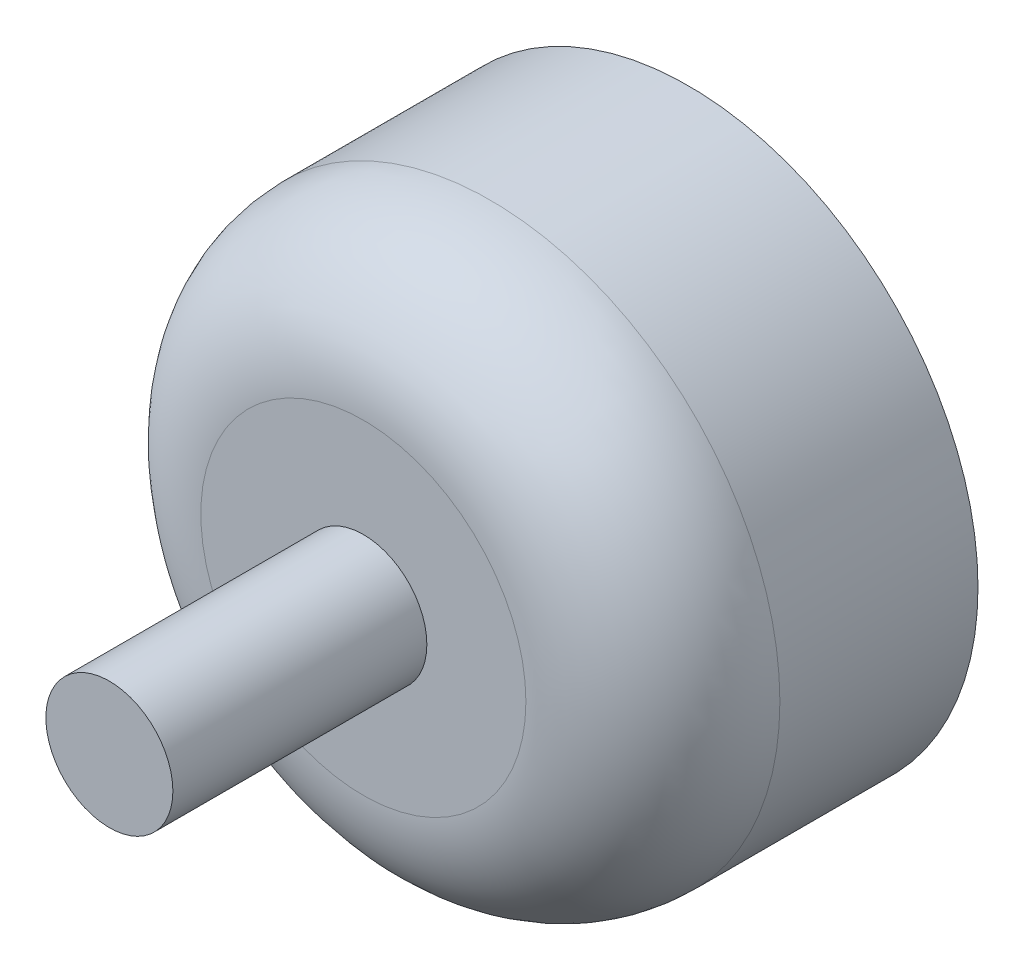
ISO-10303-21;
HEADER;
FILE_DESCRIPTION(('STEP AP214'),'2;1');
FILE_NAME('part.step','',(''),(''),'','','');
FILE_SCHEMA(('AUTOMOTIVE_DESIGN { 1 0 10303 214 1 1 1 1 }'));
ENDSEC;
DATA;
#1=APPLICATION_CONTEXT('core data for automotive mechanical design processes');
#2=APPLICATION_PROTOCOL_DEFINITION('international standard','automotive_design',2000,#1);
#3=PRODUCT_CONTEXT('',#1,'mechanical');
#4=PRODUCT('Part','Part','',(#3));
#5=PRODUCT_RELATED_PRODUCT_CATEGORY('part','',(#4));
#6=PRODUCT_DEFINITION_FORMATION('','',#4);
#7=PRODUCT_DEFINITION_CONTEXT('part definition',#1,'design');
#8=PRODUCT_DEFINITION('design','',#6,#7);
#9=PRODUCT_DEFINITION_SHAPE('','',#8);
#10=(LENGTH_UNIT() NAMED_UNIT(*) SI_UNIT(.MILLI.,.METRE.));
#11=(NAMED_UNIT(*) PLANE_ANGLE_UNIT() SI_UNIT($,.RADIAN.));
#12=(NAMED_UNIT(*) SI_UNIT($,.STERADIAN.) SOLID_ANGLE_UNIT());
#13=UNCERTAINTY_MEASURE_WITH_UNIT(LENGTH_MEASURE(1.E-05),#10,'distance_accuracy_value','');
#14=(GEOMETRIC_REPRESENTATION_CONTEXT(3) GLOBAL_UNCERTAINTY_ASSIGNED_CONTEXT((#13)) GLOBAL_UNIT_ASSIGNED_CONTEXT((#10,
#11,#12)) REPRESENTATION_CONTEXT('',''));
#15=CARTESIAN_POINT('',(0.,0.,0.));
#16=DIRECTION('',(0.,0.,1.));
#17=DIRECTION('',(1.,0.,0.));
#18=AXIS2_PLACEMENT_3D('',#15,#16,#17);
#19=CARTESIAN_POINT('',(0.,0.,12.8));
#20=DIRECTION('',(0.,0.,-1.));
#21=DIRECTION('',(-1.,0.,0.));
#22=AXIS2_PLACEMENT_3D('',#19,#20,#21);
#23=CYLINDRICAL_SURFACE('',#22,11.4);
#24=CARTESIAN_POINT('',(0.,0.,7.8));
#25=DIRECTION('',(0.,0.,1.));
#26=DIRECTION('',(1.,0.,0.));
#27=AXIS2_PLACEMENT_3D('',#24,#25,#26);
#28=CIRCLE('',#27,11.4);
#29=CARTESIAN_POINT('',(11.4,0.,7.8));
#30=VERTEX_POINT('',#29);
#31=EDGE_CURVE('E10',#30,#30,#28,.F.);
#32=ORIENTED_EDGE('',*,*,#31,.T.);
#33=EDGE_LOOP('',(#32));
#34=FACE_BOUND('',#33,.T.);
#35=CARTESIAN_POINT('',(0.,0.,0.));
#36=DIRECTION('',(0.,0.,1.));
#37=DIRECTION('',(1.,0.,0.));
#38=AXIS2_PLACEMENT_3D('',#35,#36,#37);
#39=CIRCLE('',#38,11.4);
#40=CARTESIAN_POINT('',(11.4,0.,0.));
#41=VERTEX_POINT('',#40);
#42=EDGE_CURVE('E52',#41,#41,#39,.T.);
#43=ORIENTED_EDGE('',*,*,#42,.T.);
#44=EDGE_LOOP('',(#43));
#45=FACE_BOUND('',#44,.T.);
#46=ADVANCED_FACE('F31',(#34,#45),#23,.T.);
#47=CARTESIAN_POINT('',(0.,0.,12.8));
#48=DIRECTION('',(0.,0.,1.));
#49=DIRECTION('',(1.,0.,0.));
#50=AXIS2_PLACEMENT_3D('',#47,#48,#49);
#51=PLANE('',#50);
#52=CARTESIAN_POINT('',(0.,0.,12.8));
#53=DIRECTION('',(0.,0.,1.));
#54=DIRECTION('',(1.,0.,0.));
#55=AXIS2_PLACEMENT_3D('',#52,#53,#54);
#56=CIRCLE('',#55,6.4);
#57=CARTESIAN_POINT('',(6.4,0.,12.8));
#58=VERTEX_POINT('',#57);
#59=EDGE_CURVE('E38',#58,#58,#56,.T.);
#60=ORIENTED_EDGE('',*,*,#59,.T.);
#61=EDGE_LOOP('',(#60));
#62=FACE_BOUND('',#61,.T.);
#63=CARTESIAN_POINT('',(0.,0.,12.8));
#64=DIRECTION('',(0.,0.,1.));
#65=DIRECTION('',(1.,0.,0.));
#66=AXIS2_PLACEMENT_3D('',#63,#64,#65);
#67=CIRCLE('',#66,2.5);
#68=CARTESIAN_POINT('',(2.5,0.,12.8));
#69=VERTEX_POINT('',#68);
#70=EDGE_CURVE('E42',#69,#69,#67,.T.);
#71=ORIENTED_EDGE('',*,*,#70,.F.);
#72=EDGE_LOOP('',(#71));
#73=FACE_BOUND('',#72,.T.);
#74=ADVANCED_FACE('F100',(#62,#73),#51,.T.);
#75=CARTESIAN_POINT('',(0.,0.,0.));
#76=DIRECTION('',(0.,0.,1.));
#77=DIRECTION('',(1.,0.,0.));
#78=AXIS2_PLACEMENT_3D('',#75,#76,#77);
#79=PLANE('',#78);
#80=CARTESIAN_POINT('',(0.,0.,0.));
#81=DIRECTION('',(0.,0.,1.));
#82=DIRECTION('',(1.,0.,0.));
#83=AXIS2_PLACEMENT_3D('',#80,#81,#82);
#84=CIRCLE('',#83,3.);
#85=CARTESIAN_POINT('',(3.,0.,0.));
#86=VERTEX_POINT('',#85);
#87=EDGE_CURVE('E49',#86,#86,#84,.F.);
#88=ORIENTED_EDGE('',*,*,#87,.F.);
#89=EDGE_LOOP('',(#88));
#90=FACE_BOUND('',#89,.T.);
#91=CARTESIAN_POINT('',(0.,6.,0.));
#92=DIRECTION('',(0.,0.,-1.));
#93=DIRECTION('',(0.,1.,0.));
#94=AXIS2_PLACEMENT_3D('',#91,#92,#93);
#95=CIRCLE('',#94,1.);
#96=CARTESIAN_POINT('',(0.,7.,0.));
#97=VERTEX_POINT('',#96);
#98=EDGE_CURVE('E75',#97,#97,#95,.T.);
#99=ORIENTED_EDGE('',*,*,#98,.F.);
#100=EDGE_LOOP('',(#99));
#101=FACE_BOUND('',#100,.T.);
#102=CARTESIAN_POINT('',(6.,0.,0.));
#103=DIRECTION('',(0.,0.,-1.));
#104=DIRECTION('',(1.,0.,0.));
#105=AXIS2_PLACEMENT_3D('',#102,#103,#104);
#106=CIRCLE('',#105,1.);
#107=CARTESIAN_POINT('',(7.,0.,0.));
#108=VERTEX_POINT('',#107);
#109=EDGE_CURVE('E69',#108,#108,#106,.T.);
#110=ORIENTED_EDGE('',*,*,#109,.F.);
#111=EDGE_LOOP('',(#110));
#112=FACE_BOUND('',#111,.T.);
#113=CARTESIAN_POINT('',(0.,-6.,0.));
#114=DIRECTION('',(0.,0.,-1.));
#115=DIRECTION('',(0.,-1.,0.));
#116=AXIS2_PLACEMENT_3D('',#113,#114,#115);
#117=CIRCLE('',#116,1.);
#118=CARTESIAN_POINT('',(0.,-7.,0.));
#119=VERTEX_POINT('',#118);
#120=EDGE_CURVE('E62',#119,#119,#117,.T.);
#121=ORIENTED_EDGE('',*,*,#120,.F.);
#122=EDGE_LOOP('',(#121));
#123=FACE_BOUND('',#122,.T.);
#124=CARTESIAN_POINT('',(-6.,0.,0.));
#125=DIRECTION('',(0.,0.,-1.));
#126=DIRECTION('',(-1.,0.,0.));
#127=AXIS2_PLACEMENT_3D('',#124,#125,#126);
#128=CIRCLE('',#127,1.);
#129=CARTESIAN_POINT('',(-7.,0.,0.));
#130=VERTEX_POINT('',#129);
#131=EDGE_CURVE('E56',#130,#130,#128,.T.);
#132=ORIENTED_EDGE('',*,*,#131,.F.);
#133=EDGE_LOOP('',(#132));
#134=FACE_BOUND('',#133,.T.);
#135=ORIENTED_EDGE('',*,*,#42,.F.);
#136=EDGE_LOOP('',(#135));
#137=FACE_BOUND('',#136,.T.);
#138=ADVANCED_FACE('F102',(#90,#101,#112,#123,#134,#137),#79,.F.);
#139=CARTESIAN_POINT('',(-6.,0.,3.));
#140=DIRECTION('',(0.,0.,-1.));
#141=DIRECTION('',(-1.,0.,0.));
#142=AXIS2_PLACEMENT_3D('',#139,#140,#141);
#143=CYLINDRICAL_SURFACE('',#142,1.);
#144=CARTESIAN_POINT('',(-6.,0.,3.));
#145=DIRECTION('',(0.,0.,-1.));
#146=DIRECTION('',(-1.,0.,0.));
#147=AXIS2_PLACEMENT_3D('',#144,#145,#146);
#148=CIRCLE('',#147,1.);
#149=CARTESIAN_POINT('',(-7.,0.,3.));
#150=VERTEX_POINT('',#149);
#151=EDGE_CURVE('E55',#150,#150,#148,.T.);
#152=ORIENTED_EDGE('',*,*,#151,.F.);
#153=EDGE_LOOP('',(#152));
#154=FACE_BOUND('',#153,.T.);
#155=ORIENTED_EDGE('',*,*,#131,.T.);
#156=EDGE_LOOP('',(#155));
#157=FACE_BOUND('',#156,.T.);
#158=ADVANCED_FACE('F108',(#154,#157),#143,.F.);
#159=CARTESIAN_POINT('',(-6.,0.,3.));
#160=DIRECTION('',(0.,0.,-1.));
#161=DIRECTION('',(-1.,0.,0.));
#162=AXIS2_PLACEMENT_3D('',#159,#160,#161);
#163=PLANE('',#162);
#164=ORIENTED_EDGE('',*,*,#151,.T.);
#165=EDGE_LOOP('',(#164));
#166=FACE_BOUND('',#165,.T.);
#167=ADVANCED_FACE('F114',(#166),#163,.T.);
#168=CARTESIAN_POINT('',(0.,-6.,3.));
#169=DIRECTION('',(0.,0.,-1.));
#170=DIRECTION('',(-1.,0.,0.));
#171=AXIS2_PLACEMENT_3D('',#168,#169,#170);
#172=CYLINDRICAL_SURFACE('',#171,1.);
#173=CARTESIAN_POINT('',(0.,-6.,3.));
#174=DIRECTION('',(0.,0.,-1.));
#175=DIRECTION('',(0.,-1.,0.));
#176=AXIS2_PLACEMENT_3D('',#173,#174,#175);
#177=CIRCLE('',#176,1.);
#178=CARTESIAN_POINT('',(0.,-7.,3.));
#179=VERTEX_POINT('',#178);
#180=EDGE_CURVE('E65',#179,#179,#177,.T.);
#181=ORIENTED_EDGE('',*,*,#180,.F.);
#182=EDGE_LOOP('',(#181));
#183=FACE_BOUND('',#182,.T.);
#184=ORIENTED_EDGE('',*,*,#120,.T.);
#185=EDGE_LOOP('',(#184));
#186=FACE_BOUND('',#185,.T.);
#187=ADVANCED_FACE('F118',(#183,#186),#172,.F.);
#188=CARTESIAN_POINT('',(0.,-6.,3.));
#189=DIRECTION('',(0.,0.,-1.));
#190=DIRECTION('',(0.,-1.,0.));
#191=AXIS2_PLACEMENT_3D('',#188,#189,#190);
#192=PLANE('',#191);
#193=ORIENTED_EDGE('',*,*,#180,.T.);
#194=EDGE_LOOP('',(#193));
#195=FACE_BOUND('',#194,.T.);
#196=ADVANCED_FACE('F122',(#195),#192,.T.);
#197=CARTESIAN_POINT('',(6.,0.,3.));
#198=DIRECTION('',(0.,0.,-1.));
#199=DIRECTION('',(-1.,0.,0.));
#200=AXIS2_PLACEMENT_3D('',#197,#198,#199);
#201=CYLINDRICAL_SURFACE('',#200,1.);
#202=CARTESIAN_POINT('',(6.,0.,3.));
#203=DIRECTION('',(0.,0.,-1.));
#204=DIRECTION('',(1.,0.,0.));
#205=AXIS2_PLACEMENT_3D('',#202,#203,#204);
#206=CIRCLE('',#205,1.);
#207=CARTESIAN_POINT('',(7.,0.,3.));
#208=VERTEX_POINT('',#207);
#209=EDGE_CURVE('E72',#208,#208,#206,.T.);
#210=ORIENTED_EDGE('',*,*,#209,.F.);
#211=EDGE_LOOP('',(#210));
#212=FACE_BOUND('',#211,.T.);
#213=ORIENTED_EDGE('',*,*,#109,.T.);
#214=EDGE_LOOP('',(#213));
#215=FACE_BOUND('',#214,.T.);
#216=ADVANCED_FACE('F126',(#212,#215),#201,.F.);
#217=CARTESIAN_POINT('',(6.,0.,3.));
#218=DIRECTION('',(0.,0.,-1.));
#219=DIRECTION('',(1.,0.,0.));
#220=AXIS2_PLACEMENT_3D('',#217,#218,#219);
#221=PLANE('',#220);
#222=ORIENTED_EDGE('',*,*,#209,.T.);
#223=EDGE_LOOP('',(#222));
#224=FACE_BOUND('',#223,.T.);
#225=ADVANCED_FACE('F130',(#224),#221,.T.);
#226=CARTESIAN_POINT('',(0.,6.,3.));
#227=DIRECTION('',(0.,0.,-1.));
#228=DIRECTION('',(-1.,0.,0.));
#229=AXIS2_PLACEMENT_3D('',#226,#227,#228);
#230=CYLINDRICAL_SURFACE('',#229,1.);
#231=CARTESIAN_POINT('',(0.,6.,3.));
#232=DIRECTION('',(0.,0.,-1.));
#233=DIRECTION('',(0.,1.,0.));
#234=AXIS2_PLACEMENT_3D('',#231,#232,#233);
#235=CIRCLE('',#234,1.);
#236=CARTESIAN_POINT('',(0.,7.,3.));
#237=VERTEX_POINT('',#236);
#238=EDGE_CURVE('E59',#237,#237,#235,.T.);
#239=ORIENTED_EDGE('',*,*,#238,.F.);
#240=EDGE_LOOP('',(#239));
#241=FACE_BOUND('',#240,.T.);
#242=ORIENTED_EDGE('',*,*,#98,.T.);
#243=EDGE_LOOP('',(#242));
#244=FACE_BOUND('',#243,.T.);
#245=ADVANCED_FACE('F134',(#241,#244),#230,.F.);
#246=CARTESIAN_POINT('',(0.,6.,3.));
#247=DIRECTION('',(0.,0.,-1.));
#248=DIRECTION('',(0.,1.,0.));
#249=AXIS2_PLACEMENT_3D('',#246,#247,#248);
#250=PLANE('',#249);
#251=ORIENTED_EDGE('',*,*,#238,.T.);
#252=EDGE_LOOP('',(#251));
#253=FACE_BOUND('',#252,.T.);
#254=ADVANCED_FACE('F138',(#253),#250,.T.);
#255=CARTESIAN_POINT('',(0.,0.,-0.5));
#256=DIRECTION('',(0.,0.,1.));
#257=DIRECTION('',(1.,0.,0.));
#258=AXIS2_PLACEMENT_3D('',#255,#256,#257);
#259=CYLINDRICAL_SURFACE('',#258,3.);
#260=CARTESIAN_POINT('',(0.,0.,-0.5));
#261=DIRECTION('',(0.,0.,-1.));
#262=DIRECTION('',(-1.,0.,0.));
#263=AXIS2_PLACEMENT_3D('',#260,#261,#262);
#264=CIRCLE('',#263,3.);
#265=CARTESIAN_POINT('',(-3.,0.,-0.5));
#266=VERTEX_POINT('',#265);
#267=EDGE_CURVE('E66',#266,#266,#264,.T.);
#268=ORIENTED_EDGE('',*,*,#267,.F.);
#269=EDGE_LOOP('',(#268));
#270=FACE_BOUND('',#269,.T.);
#271=ORIENTED_EDGE('',*,*,#87,.T.);
#272=EDGE_LOOP('',(#271));
#273=FACE_BOUND('',#272,.T.);
#274=ADVANCED_FACE('F142',(#270,#273),#259,.T.);
#275=CARTESIAN_POINT('',(0.,0.,-0.5));
#276=DIRECTION('',(0.,0.,-1.));
#277=DIRECTION('',(-1.,0.,0.));
#278=AXIS2_PLACEMENT_3D('',#275,#276,#277);
#279=PLANE('',#278);
#280=CARTESIAN_POINT('',(0.,0.,-0.5));
#281=DIRECTION('',(0.,0.,-1.));
#282=DIRECTION('',(-1.,0.,0.));
#283=AXIS2_PLACEMENT_3D('',#280,#281,#282);
#284=CIRCLE('',#283,1.5);
#285=CARTESIAN_POINT('',(-1.5,0.,-0.5));
#286=VERTEX_POINT('',#285);
#287=EDGE_CURVE('E46',#286,#286,#284,.T.);
#288=ORIENTED_EDGE('',*,*,#287,.F.);
#289=EDGE_LOOP('',(#288));
#290=FACE_BOUND('',#289,.T.);
#291=ORIENTED_EDGE('',*,*,#267,.T.);
#292=EDGE_LOOP('',(#291));
#293=FACE_BOUND('',#292,.T.);
#294=ADVANCED_FACE('F146',(#290,#293),#279,.T.);
#295=CARTESIAN_POINT('',(0.,0.,-1.5));
#296=DIRECTION('',(0.,0.,1.));
#297=DIRECTION('',(1.,0.,0.));
#298=AXIS2_PLACEMENT_3D('',#295,#296,#297);
#299=CYLINDRICAL_SURFACE('',#298,1.5);
#300=CARTESIAN_POINT('',(0.,0.,-1.5));
#301=DIRECTION('',(0.,0.,-1.));
#302=DIRECTION('',(-1.,0.,0.));
#303=AXIS2_PLACEMENT_3D('',#300,#301,#302);
#304=CIRCLE('',#303,1.5);
#305=CARTESIAN_POINT('',(-1.5,0.,-1.5));
#306=VERTEX_POINT('',#305);
#307=EDGE_CURVE('E82',#306,#306,#304,.T.);
#308=ORIENTED_EDGE('',*,*,#307,.F.);
#309=EDGE_LOOP('',(#308));
#310=FACE_BOUND('',#309,.T.);
#311=ORIENTED_EDGE('',*,*,#287,.T.);
#312=EDGE_LOOP('',(#311));
#313=FACE_BOUND('',#312,.T.);
#314=ADVANCED_FACE('F150',(#310,#313),#299,.T.);
#315=CARTESIAN_POINT('',(0.,0.,-1.5));
#316=DIRECTION('',(0.,0.,-1.));
#317=DIRECTION('',(-1.,0.,0.));
#318=AXIS2_PLACEMENT_3D('',#315,#316,#317);
#319=PLANE('',#318);
#320=ORIENTED_EDGE('',*,*,#307,.T.);
#321=EDGE_LOOP('',(#320));
#322=FACE_BOUND('',#321,.T.);
#323=ADVANCED_FACE('F96',(#322),#319,.T.);
#324=CARTESIAN_POINT('',(0.,0.,22.8));
#325=DIRECTION('',(0.,0.,-1.));
#326=DIRECTION('',(-1.,0.,0.));
#327=AXIS2_PLACEMENT_3D('',#324,#325,#326);
#328=CYLINDRICAL_SURFACE('',#327,2.5);
#329=CARTESIAN_POINT('',(0.,0.,22.8));
#330=DIRECTION('',(0.,0.,1.));
#331=DIRECTION('',(1.,0.,0.));
#332=AXIS2_PLACEMENT_3D('',#329,#330,#331);
#333=CIRCLE('',#332,2.5);
#334=CARTESIAN_POINT('',(2.5,0.,22.8));
#335=VERTEX_POINT('',#334);
#336=EDGE_CURVE('E86',#335,#335,#333,.T.);
#337=ORIENTED_EDGE('',*,*,#336,.F.);
#338=EDGE_LOOP('',(#337));
#339=FACE_BOUND('',#338,.T.);
#340=ORIENTED_EDGE('',*,*,#70,.T.);
#341=EDGE_LOOP('',(#340));
#342=FACE_BOUND('',#341,.T.);
#343=ADVANCED_FACE('F93',(#339,#342),#328,.T.);
#344=CARTESIAN_POINT('',(0.,0.,22.8));
#345=DIRECTION('',(0.,0.,1.));
#346=DIRECTION('',(1.,0.,0.));
#347=AXIS2_PLACEMENT_3D('',#344,#345,#346);
#348=PLANE('',#347);
#349=ORIENTED_EDGE('',*,*,#336,.T.);
#350=EDGE_LOOP('',(#349));
#351=FACE_BOUND('',#350,.T.);
#352=ADVANCED_FACE('F91',(#351),#348,.T.);
#353=CARTESIAN_POINT('',(0.,0.,7.8));
#354=DIRECTION('',(0.,0.,1.));
#355=DIRECTION('',(1.,0.,0.));
#356=AXIS2_PLACEMENT_3D('',#353,#354,#355);
#357=TOROIDAL_SURFACE('',#356,6.4,5.);
#358=ORIENTED_EDGE('',*,*,#31,.F.);
#359=EDGE_LOOP('',(#358));
#360=FACE_BOUND('',#359,.T.);
#361=ORIENTED_EDGE('',*,*,#59,.F.);
#362=EDGE_LOOP('',(#361));
#363=FACE_BOUND('',#362,.T.);
#364=ADVANCED_FACE('F33',(#360,#363),#357,.T.);
#365=CLOSED_SHELL('',(#46,#74,#138,#158,#167,#187,#196,#216,#225,#245,#254,#274,#294,#314,#323,
#343,#352,#364));
#366=MANIFOLD_SOLID_BREP('B2',#365);
#367=ADVANCED_BREP_SHAPE_REPRESENTATION('',(#18,#366),#14);
#368=SHAPE_DEFINITION_REPRESENTATION(#9,#367);
ENDSEC;
END-ISO-10303-21;
